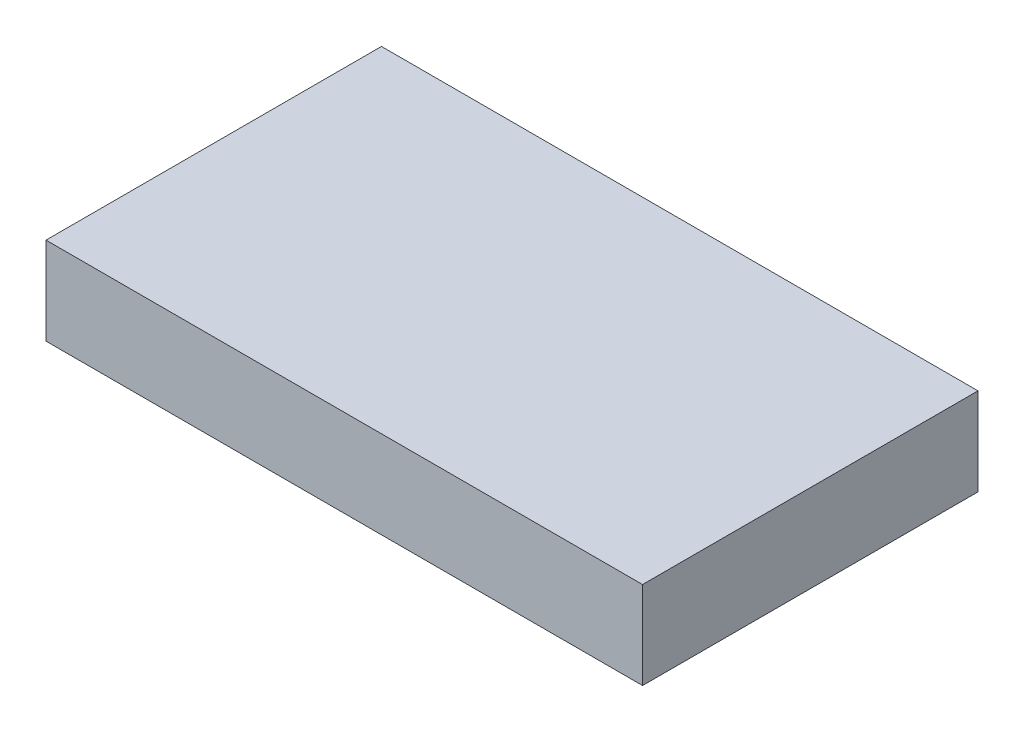
ISO-10303-21;
HEADER;
FILE_DESCRIPTION(('STEP AP214'),'2;1');
FILE_NAME('part.step','',(''),(''),'','','');
FILE_SCHEMA(('AUTOMOTIVE_DESIGN { 1 0 10303 214 1 1 1 1 }'));
ENDSEC;
DATA;
#1=APPLICATION_CONTEXT('core data for automotive mechanical design processes');
#2=APPLICATION_PROTOCOL_DEFINITION('international standard','automotive_design',2000,#1);
#3=PRODUCT_CONTEXT('',#1,'mechanical');
#4=PRODUCT('Part','Part','',(#3));
#5=PRODUCT_RELATED_PRODUCT_CATEGORY('part','',(#4));
#6=PRODUCT_DEFINITION_FORMATION('','',#4);
#7=PRODUCT_DEFINITION_CONTEXT('part definition',#1,'design');
#8=PRODUCT_DEFINITION('design','',#6,#7);
#9=PRODUCT_DEFINITION_SHAPE('','',#8);
#10=(LENGTH_UNIT() NAMED_UNIT(*) SI_UNIT(.MILLI.,.METRE.));
#11=(NAMED_UNIT(*) PLANE_ANGLE_UNIT() SI_UNIT($,.RADIAN.));
#12=(NAMED_UNIT(*) SI_UNIT($,.STERADIAN.) SOLID_ANGLE_UNIT());
#13=UNCERTAINTY_MEASURE_WITH_UNIT(LENGTH_MEASURE(1.E-05),#10,'distance_accuracy_value','');
#14=(GEOMETRIC_REPRESENTATION_CONTEXT(3) GLOBAL_UNCERTAINTY_ASSIGNED_CONTEXT((#13)) GLOBAL_UNIT_ASSIGNED_CONTEXT((#10,
#11,#12)) REPRESENTATION_CONTEXT('',''));
#15=CARTESIAN_POINT('',(0.,0.,0.));
#16=DIRECTION('',(0.,0.,1.));
#17=DIRECTION('',(1.,0.,0.));
#18=AXIS2_PLACEMENT_3D('',#15,#16,#17);
#19=CARTESIAN_POINT('',(-71.3651652173913,15.24,-52.8463565217392));
#20=DIRECTION('',(1.,0.,0.));
#21=DIRECTION('',(0.,0.,-1.));
#22=AXIS2_PLACEMENT_3D('',#19,#20,#21);
#23=PLANE('',#22);
#24=DIRECTION('',(0.,0.,1.));
#25=VECTOR('',#24,1.);
#26=CARTESIAN_POINT('',(-71.3651652173913,0.,-52.8463565217392));
#27=LINE('',#26,#25);
#28=CARTESIAN_POINT('',(-71.3651652173913,0.,-52.8463565217392));
#29=VERTEX_POINT('',#28);
#30=CARTESIAN_POINT('',(-71.3651652173912,0.,5.57364347826082));
#31=VERTEX_POINT('',#30);
#32=EDGE_CURVE('E96',#29,#31,#27,.T.);
#33=ORIENTED_EDGE('',*,*,#32,.T.);
#34=DIRECTION('',(0.,-1.,0.));
#35=VECTOR('',#34,1.);
#36=CARTESIAN_POINT('',(-71.3651652173912,15.24,5.57364347826082));
#37=LINE('',#36,#35);
#38=CARTESIAN_POINT('',(-71.3651652173912,15.24,5.57364347826082));
#39=VERTEX_POINT('',#38);
#40=EDGE_CURVE('E11',#39,#31,#37,.T.);
#41=ORIENTED_EDGE('',*,*,#40,.F.);
#42=DIRECTION('',(0.,0.,1.));
#43=VECTOR('',#42,1.);
#44=CARTESIAN_POINT('',(-71.3651652173913,15.24,-52.8463565217392));
#45=LINE('',#44,#43);
#46=CARTESIAN_POINT('',(-71.3651652173913,15.24,-52.8463565217392));
#47=VERTEX_POINT('',#46);
#48=EDGE_CURVE('E84',#47,#39,#45,.T.);
#49=ORIENTED_EDGE('',*,*,#48,.F.);
#50=DIRECTION('',(0.,-1.,0.));
#51=VECTOR('',#50,1.);
#52=CARTESIAN_POINT('',(-71.3651652173913,15.24,-52.8463565217392));
#53=LINE('',#52,#51);
#54=EDGE_CURVE('E92',#47,#29,#53,.T.);
#55=ORIENTED_EDGE('',*,*,#54,.T.);
#56=EDGE_LOOP('',(#33,#41,#49,#55));
#57=FACE_BOUND('',#56,.T.);
#58=ADVANCED_FACE('F33',(#57),#23,.F.);
#59=CARTESIAN_POINT('',(-71.3651652173912,15.24,5.57364347826082));
#60=DIRECTION('',(0.,0.,-1.));
#61=DIRECTION('',(-1.,0.,0.));
#62=AXIS2_PLACEMENT_3D('',#59,#60,#61);
#63=PLANE('',#62);
#64=DIRECTION('',(1.,0.,0.));
#65=VECTOR('',#64,1.);
#66=CARTESIAN_POINT('',(-71.3651652173912,0.,5.57364347826082));
#67=LINE('',#66,#65);
#68=CARTESIAN_POINT('',(32.5208347826087,0.,5.57364347826082));
#69=VERTEX_POINT('',#68);
#70=EDGE_CURVE('E88',#31,#69,#67,.T.);
#71=ORIENTED_EDGE('',*,*,#70,.T.);
#72=DIRECTION('',(0.,-1.,0.));
#73=VECTOR('',#72,1.);
#74=CARTESIAN_POINT('',(32.5208347826087,15.24,5.57364347826082));
#75=LINE('',#74,#73);
#76=CARTESIAN_POINT('',(32.5208347826087,15.24,5.57364347826082));
#77=VERTEX_POINT('',#76);
#78=EDGE_CURVE('E41',#77,#69,#75,.T.);
#79=ORIENTED_EDGE('',*,*,#78,.F.);
#80=DIRECTION('',(1.,0.,0.));
#81=VECTOR('',#80,1.);
#82=CARTESIAN_POINT('',(-71.3651652173912,15.24,5.57364347826082));
#83=LINE('',#82,#81);
#84=EDGE_CURVE('E79',#39,#77,#83,.T.);
#85=ORIENTED_EDGE('',*,*,#84,.F.);
#86=ORIENTED_EDGE('',*,*,#40,.T.);
#87=EDGE_LOOP('',(#71,#79,#85,#86));
#88=FACE_BOUND('',#87,.T.);
#89=ADVANCED_FACE('F87',(#88),#63,.F.);
#90=CARTESIAN_POINT('',(32.5208347826087,15.24,-52.8463565217392));
#91=DIRECTION('',(-1.,0.,0.));
#92=DIRECTION('',(0.,0.,1.));
#93=AXIS2_PLACEMENT_3D('',#90,#91,#92);
#94=PLANE('',#93);
#95=DIRECTION('',(0.,0.,-1.));
#96=VECTOR('',#95,1.);
#97=CARTESIAN_POINT('',(32.5208347826087,0.,-52.8463565217392));
#98=LINE('',#97,#96);
#99=CARTESIAN_POINT('',(32.5208347826087,0.,-52.8463565217392));
#100=VERTEX_POINT('',#99);
#101=EDGE_CURVE('E66',#69,#100,#98,.T.);
#102=ORIENTED_EDGE('',*,*,#101,.T.);
#103=DIRECTION('',(0.,-1.,0.));
#104=VECTOR('',#103,1.);
#105=CARTESIAN_POINT('',(32.5208347826087,15.24,-52.8463565217392));
#106=LINE('',#105,#104);
#107=CARTESIAN_POINT('',(32.5208347826087,15.24,-52.8463565217392));
#108=VERTEX_POINT('',#107);
#109=EDGE_CURVE('E89',#108,#100,#106,.T.);
#110=ORIENTED_EDGE('',*,*,#109,.F.);
#111=DIRECTION('',(0.,0.,-1.));
#112=VECTOR('',#111,1.);
#113=CARTESIAN_POINT('',(32.5208347826087,15.24,-52.8463565217392));
#114=LINE('',#113,#112);
#115=EDGE_CURVE('E82',#77,#108,#114,.T.);
#116=ORIENTED_EDGE('',*,*,#115,.F.);
#117=ORIENTED_EDGE('',*,*,#78,.T.);
#118=EDGE_LOOP('',(#102,#110,#116,#117));
#119=FACE_BOUND('',#118,.T.);
#120=ADVANCED_FACE('F90',(#119),#94,.F.);
#121=CARTESIAN_POINT('',(-71.3651652173913,15.24,-52.8463565217392));
#122=DIRECTION('',(0.,0.,1.));
#123=DIRECTION('',(1.,0.,0.));
#124=AXIS2_PLACEMENT_3D('',#121,#122,#123);
#125=PLANE('',#124);
#126=DIRECTION('',(-1.,0.,0.));
#127=VECTOR('',#126,1.);
#128=CARTESIAN_POINT('',(-71.3651652173913,0.,-52.8463565217392));
#129=LINE('',#128,#127);
#130=EDGE_CURVE('E72',#100,#29,#129,.T.);
#131=ORIENTED_EDGE('',*,*,#130,.T.);
#132=ORIENTED_EDGE('',*,*,#54,.F.);
#133=DIRECTION('',(-1.,0.,0.));
#134=VECTOR('',#133,1.);
#135=CARTESIAN_POINT('',(-71.3651652173913,15.24,-52.8463565217392));
#136=LINE('',#135,#134);
#137=EDGE_CURVE('E49',#108,#47,#136,.T.);
#138=ORIENTED_EDGE('',*,*,#137,.F.);
#139=ORIENTED_EDGE('',*,*,#109,.T.);
#140=EDGE_LOOP('',(#131,#132,#138,#139));
#141=FACE_BOUND('',#140,.T.);
#142=ADVANCED_FACE('F103',(#141),#125,.F.);
#143=CARTESIAN_POINT('',(0.,15.24,0.));
#144=DIRECTION('',(0.,1.,0.));
#145=DIRECTION('',(0.,0.,1.));
#146=AXIS2_PLACEMENT_3D('',#143,#144,#145);
#147=PLANE('',#146);
#148=ORIENTED_EDGE('',*,*,#48,.T.);
#149=ORIENTED_EDGE('',*,*,#84,.T.);
#150=ORIENTED_EDGE('',*,*,#115,.T.);
#151=ORIENTED_EDGE('',*,*,#137,.T.);
#152=EDGE_LOOP('',(#148,#149,#150,#151));
#153=FACE_BOUND('',#152,.T.);
#154=ADVANCED_FACE('F80',(#153),#147,.T.);
#155=CARTESIAN_POINT('',(0.,0.,0.));
#156=DIRECTION('',(0.,1.,0.));
#157=DIRECTION('',(0.,0.,1.));
#158=AXIS2_PLACEMENT_3D('',#155,#156,#157);
#159=PLANE('',#158);
#160=ORIENTED_EDGE('',*,*,#32,.F.);
#161=ORIENTED_EDGE('',*,*,#130,.F.);
#162=ORIENTED_EDGE('',*,*,#101,.F.);
#163=ORIENTED_EDGE('',*,*,#70,.F.);
#164=EDGE_LOOP('',(#160,#161,#162,#163));
#165=FACE_BOUND('',#164,.T.);
#166=ADVANCED_FACE('F106',(#165),#159,.F.);
#167=CLOSED_SHELL('',(#58,#89,#120,#142,#154,#166));
#168=MANIFOLD_SOLID_BREP('B2',#167);
#169=ADVANCED_BREP_SHAPE_REPRESENTATION('',(#18,#168),#14);
#170=SHAPE_DEFINITION_REPRESENTATION(#9,#169);
ENDSEC;
END-ISO-10303-21;
